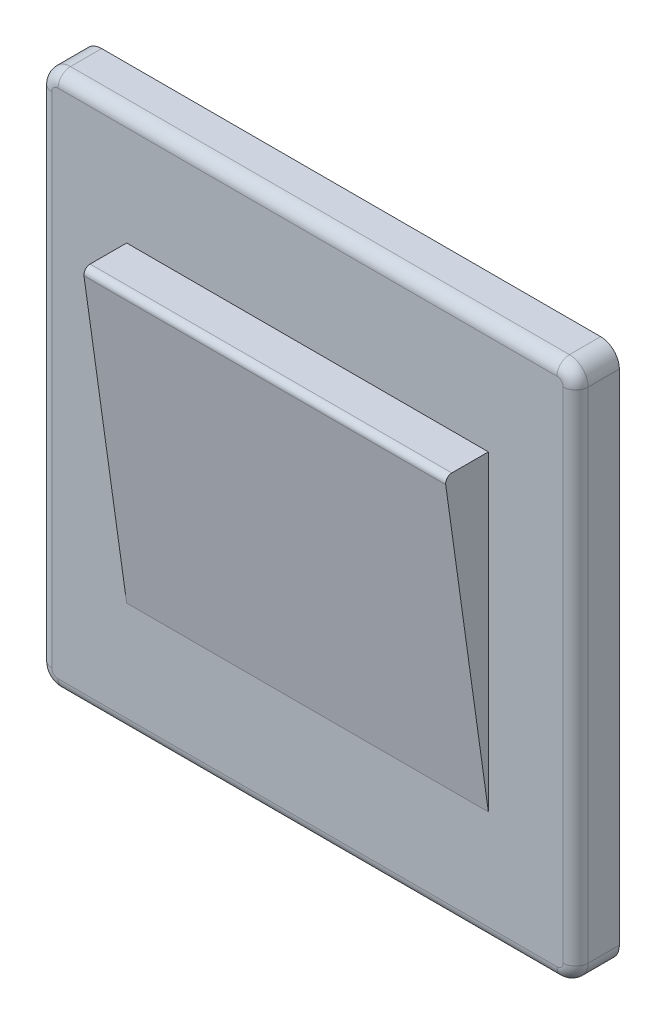
ISO-10303-21;
HEADER;
FILE_DESCRIPTION(('STEP AP214'),'2;1');
FILE_NAME('part.step','',(''),(''),'','','');
FILE_SCHEMA(('AUTOMOTIVE_DESIGN { 1 0 10303 214 1 1 1 1 }'));
ENDSEC;
DATA;
#1=APPLICATION_CONTEXT('core data for automotive mechanical design processes');
#2=APPLICATION_PROTOCOL_DEFINITION('international standard','automotive_design',2000,#1);
#3=PRODUCT_CONTEXT('',#1,'mechanical');
#4=PRODUCT('Part','Part','',(#3));
#5=PRODUCT_RELATED_PRODUCT_CATEGORY('part','',(#4));
#6=PRODUCT_DEFINITION_FORMATION('','',#4);
#7=PRODUCT_DEFINITION_CONTEXT('part definition',#1,'design');
#8=PRODUCT_DEFINITION('design','',#6,#7);
#9=PRODUCT_DEFINITION_SHAPE('','',#8);
#10=(LENGTH_UNIT() NAMED_UNIT(*) SI_UNIT(.MILLI.,.METRE.));
#11=(NAMED_UNIT(*) PLANE_ANGLE_UNIT() SI_UNIT($,.RADIAN.));
#12=(NAMED_UNIT(*) SI_UNIT($,.STERADIAN.) SOLID_ANGLE_UNIT());
#13=UNCERTAINTY_MEASURE_WITH_UNIT(LENGTH_MEASURE(1.E-05),#10,'distance_accuracy_value','');
#14=(GEOMETRIC_REPRESENTATION_CONTEXT(3) GLOBAL_UNCERTAINTY_ASSIGNED_CONTEXT((#13)) GLOBAL_UNIT_ASSIGNED_CONTEXT((#10,
#11,#12)) REPRESENTATION_CONTEXT('',''));
#15=CARTESIAN_POINT('',(0.,0.,0.));
#16=DIRECTION('',(0.,0.,1.));
#17=DIRECTION('',(1.,0.,0.));
#18=AXIS2_PLACEMENT_3D('',#15,#16,#17);
#19=CARTESIAN_POINT('',(0.,0.,7.));
#20=DIRECTION('',(0.,1.,0.));
#21=DIRECTION('',(0.,0.,1.));
#22=AXIS2_PLACEMENT_3D('',#19,#20,#21);
#23=PLANE('',#22);
#24=DIRECTION('',(0.,0.,-1.));
#25=VECTOR('',#24,1.);
#26=CARTESIAN_POINT('',(83.,0.,7.));
#27=LINE('',#26,#25);
#28=CARTESIAN_POINT('',(83.,0.,0.));
#29=VERTEX_POINT('',#28);
#30=CARTESIAN_POINT('',(83.,0.,5.));
#31=VERTEX_POINT('',#30);
#32=EDGE_CURVE('E225',#29,#31,#27,.F.);
#33=ORIENTED_EDGE('',*,*,#32,.T.);
#34=DIRECTION('',(1.,0.,0.));
#35=VECTOR('',#34,1.);
#36=CARTESIAN_POINT('',(3.,0.,5.));
#37=LINE('',#36,#35);
#38=CARTESIAN_POINT('',(3.,0.,5.));
#39=VERTEX_POINT('',#38);
#40=EDGE_CURVE('E265',#31,#39,#37,.F.);
#41=ORIENTED_EDGE('',*,*,#40,.T.);
#42=DIRECTION('',(0.,0.,-1.));
#43=VECTOR('',#42,1.);
#44=CARTESIAN_POINT('',(3.,0.,0.));
#45=LINE('',#44,#43);
#46=CARTESIAN_POINT('',(3.,0.,0.));
#47=VERTEX_POINT('',#46);
#48=EDGE_CURVE('E223',#39,#47,#45,.T.);
#49=ORIENTED_EDGE('',*,*,#48,.T.);
#50=DIRECTION('',(1.,0.,0.));
#51=VECTOR('',#50,1.);
#52=CARTESIAN_POINT('',(0.,0.,0.));
#53=LINE('',#52,#51);
#54=EDGE_CURVE('E195',#47,#29,#53,.T.);
#55=ORIENTED_EDGE('',*,*,#54,.T.);
#56=EDGE_LOOP('',(#33,#41,#49,#55));
#57=FACE_BOUND('',#56,.T.);
#58=ADVANCED_FACE('F48',(#57),#23,.F.);
#59=CARTESIAN_POINT('',(86.,0.,7.));
#60=DIRECTION('',(-1.,0.,0.));
#61=DIRECTION('',(0.,0.,1.));
#62=AXIS2_PLACEMENT_3D('',#59,#60,#61);
#63=PLANE('',#62);
#64=DIRECTION('',(0.,0.,-1.));
#65=VECTOR('',#64,1.);
#66=CARTESIAN_POINT('',(86.,83.,7.));
#67=LINE('',#66,#65);
#68=CARTESIAN_POINT('',(86.,83.,0.));
#69=VERTEX_POINT('',#68);
#70=CARTESIAN_POINT('',(86.,83.,5.));
#71=VERTEX_POINT('',#70);
#72=EDGE_CURVE('E221',#69,#71,#67,.F.);
#73=ORIENTED_EDGE('',*,*,#72,.T.);
#74=DIRECTION('',(0.,1.,0.));
#75=VECTOR('',#74,1.);
#76=CARTESIAN_POINT('',(86.,3.,5.));
#77=LINE('',#76,#75);
#78=CARTESIAN_POINT('',(86.,3.,5.));
#79=VERTEX_POINT('',#78);
#80=EDGE_CURVE('E269',#71,#79,#77,.F.);
#81=ORIENTED_EDGE('',*,*,#80,.T.);
#82=DIRECTION('',(0.,0.,-1.));
#83=VECTOR('',#82,1.);
#84=CARTESIAN_POINT('',(86.,3.,7.));
#85=LINE('',#84,#83);
#86=CARTESIAN_POINT('',(86.,3.,0.));
#87=VERTEX_POINT('',#86);
#88=EDGE_CURVE('E219',#79,#87,#85,.T.);
#89=ORIENTED_EDGE('',*,*,#88,.T.);
#90=DIRECTION('',(0.,1.,0.));
#91=VECTOR('',#90,1.);
#92=CARTESIAN_POINT('',(86.,0.,0.));
#93=LINE('',#92,#91);
#94=EDGE_CURVE('E198',#87,#69,#93,.T.);
#95=ORIENTED_EDGE('',*,*,#94,.T.);
#96=EDGE_LOOP('',(#73,#81,#89,#95));
#97=FACE_BOUND('',#96,.T.);
#98=ADVANCED_FACE('F318',(#97),#63,.F.);
#99=CARTESIAN_POINT('',(0.,86.,7.));
#100=DIRECTION('',(0.,1.,0.));
#101=DIRECTION('',(0.,0.,1.));
#102=AXIS2_PLACEMENT_3D('',#99,#100,#101);
#103=PLANE('',#102);
#104=DIRECTION('',(0.,0.,-1.));
#105=VECTOR('',#104,1.);
#106=CARTESIAN_POINT('',(3.,86.,7.));
#107=LINE('',#106,#105);
#108=CARTESIAN_POINT('',(3.,86.,0.));
#109=VERTEX_POINT('',#108);
#110=CARTESIAN_POINT('',(3.,86.,5.));
#111=VERTEX_POINT('',#110);
#112=EDGE_CURVE('E207',#109,#111,#107,.F.);
#113=ORIENTED_EDGE('',*,*,#112,.T.);
#114=DIRECTION('',(1.,0.,0.));
#115=VECTOR('',#114,1.);
#116=CARTESIAN_POINT('',(0.,86.,5.));
#117=LINE('',#116,#115);
#118=CARTESIAN_POINT('',(83.,86.,5.));
#119=VERTEX_POINT('',#118);
#120=EDGE_CURVE('E11',#111,#119,#117,.T.);
#121=ORIENTED_EDGE('',*,*,#120,.T.);
#122=DIRECTION('',(0.,0.,-1.));
#123=VECTOR('',#122,1.);
#124=CARTESIAN_POINT('',(83.,86.,0.));
#125=LINE('',#124,#123);
#126=CARTESIAN_POINT('',(83.,86.,0.));
#127=VERTEX_POINT('',#126);
#128=EDGE_CURVE('E209',#119,#127,#125,.T.);
#129=ORIENTED_EDGE('',*,*,#128,.T.);
#130=DIRECTION('',(1.,0.,0.));
#131=VECTOR('',#130,1.);
#132=CARTESIAN_POINT('',(0.,86.,0.));
#133=LINE('',#132,#131);
#134=EDGE_CURVE('E201',#109,#127,#133,.T.);
#135=ORIENTED_EDGE('',*,*,#134,.F.);
#136=EDGE_LOOP('',(#113,#121,#129,#135));
#137=FACE_BOUND('',#136,.T.);
#138=ADVANCED_FACE('F323',(#137),#103,.T.);
#139=CARTESIAN_POINT('',(0.,0.,7.));
#140=DIRECTION('',(-1.,0.,0.));
#141=DIRECTION('',(0.,0.,1.));
#142=AXIS2_PLACEMENT_3D('',#139,#140,#141);
#143=PLANE('',#142);
#144=DIRECTION('',(0.,0.,-1.));
#145=VECTOR('',#144,1.);
#146=CARTESIAN_POINT('',(0.,3.,7.));
#147=LINE('',#146,#145);
#148=CARTESIAN_POINT('',(0.,3.,0.));
#149=VERTEX_POINT('',#148);
#150=CARTESIAN_POINT('',(0.,3.,5.));
#151=VERTEX_POINT('',#150);
#152=EDGE_CURVE('E230',#149,#151,#147,.F.);
#153=ORIENTED_EDGE('',*,*,#152,.T.);
#154=DIRECTION('',(0.,1.,0.));
#155=VECTOR('',#154,1.);
#156=CARTESIAN_POINT('',(0.,0.,5.));
#157=LINE('',#156,#155);
#158=CARTESIAN_POINT('',(0.,83.,5.));
#159=VERTEX_POINT('',#158);
#160=EDGE_CURVE('E261',#151,#159,#157,.T.);
#161=ORIENTED_EDGE('',*,*,#160,.T.);
#162=DIRECTION('',(0.,0.,-1.));
#163=VECTOR('',#162,1.);
#164=CARTESIAN_POINT('',(0.,83.,7.));
#165=LINE('',#164,#163);
#166=CARTESIAN_POINT('',(0.,83.,0.));
#167=VERTEX_POINT('',#166);
#168=EDGE_CURVE('E228',#159,#167,#165,.T.);
#169=ORIENTED_EDGE('',*,*,#168,.T.);
#170=DIRECTION('',(0.,1.,0.));
#171=VECTOR('',#170,1.);
#172=CARTESIAN_POINT('',(0.,0.,0.));
#173=LINE('',#172,#171);
#174=EDGE_CURVE('E204',#149,#167,#173,.T.);
#175=ORIENTED_EDGE('',*,*,#174,.F.);
#176=EDGE_LOOP('',(#153,#161,#169,#175));
#177=FACE_BOUND('',#176,.T.);
#178=ADVANCED_FACE('F410',(#177),#143,.T.);
#179=CARTESIAN_POINT('',(0.,0.,7.));
#180=DIRECTION('',(0.,0.,1.));
#181=DIRECTION('',(1.,0.,0.));
#182=AXIS2_PLACEMENT_3D('',#179,#180,#181);
#183=PLANE('',#182);
#184=DIRECTION('',(1.,0.,0.));
#185=VECTOR('',#184,1.);
#186=CARTESIAN_POINT('',(0.,84.,7.));
#187=LINE('',#186,#185);
#188=CARTESIAN_POINT('',(83.,84.,7.));
#189=VERTEX_POINT('',#188);
#190=CARTESIAN_POINT('',(3.,84.,7.));
#191=VERTEX_POINT('',#190);
#192=EDGE_CURVE('E241',#189,#191,#187,.F.);
#193=ORIENTED_EDGE('',*,*,#192,.T.);
#194=CARTESIAN_POINT('',(3.,83.,7.));
#195=DIRECTION('',(0.,0.,1.));
#196=DIRECTION('',(1.,0.,0.));
#197=AXIS2_PLACEMENT_3D('',#194,#195,#196);
#198=CIRCLE('',#197,1.);
#199=CARTESIAN_POINT('',(2.,83.,7.));
#200=VERTEX_POINT('',#199);
#201=EDGE_CURVE('E255',#191,#200,#198,.T.);
#202=ORIENTED_EDGE('',*,*,#201,.T.);
#203=DIRECTION('',(0.,1.,0.));
#204=VECTOR('',#203,1.);
#205=CARTESIAN_POINT('',(2.,0.,7.));
#206=LINE('',#205,#204);
#207=CARTESIAN_POINT('',(2.,3.,7.));
#208=VERTEX_POINT('',#207);
#209=EDGE_CURVE('E253',#200,#208,#206,.F.);
#210=ORIENTED_EDGE('',*,*,#209,.T.);
#211=CARTESIAN_POINT('',(3.,3.,7.));
#212=DIRECTION('',(0.,0.,1.));
#213=DIRECTION('',(1.,0.,0.));
#214=AXIS2_PLACEMENT_3D('',#211,#212,#213);
#215=CIRCLE('',#214,1.);
#216=CARTESIAN_POINT('',(3.,2.,7.));
#217=VERTEX_POINT('',#216);
#218=EDGE_CURVE('E251',#208,#217,#215,.T.);
#219=ORIENTED_EDGE('',*,*,#218,.T.);
#220=DIRECTION('',(1.,0.,0.));
#221=VECTOR('',#220,1.);
#222=CARTESIAN_POINT('',(83.,2.,7.));
#223=LINE('',#222,#221);
#224=CARTESIAN_POINT('',(83.,2.,7.));
#225=VERTEX_POINT('',#224);
#226=EDGE_CURVE('E249',#217,#225,#223,.T.);
#227=ORIENTED_EDGE('',*,*,#226,.T.);
#228=CARTESIAN_POINT('',(83.,3.,7.));
#229=DIRECTION('',(0.,0.,1.));
#230=DIRECTION('',(1.,0.,0.));
#231=AXIS2_PLACEMENT_3D('',#228,#229,#230);
#232=CIRCLE('',#231,1.);
#233=CARTESIAN_POINT('',(84.,3.,7.));
#234=VERTEX_POINT('',#233);
#235=EDGE_CURVE('E247',#225,#234,#232,.T.);
#236=ORIENTED_EDGE('',*,*,#235,.T.);
#237=DIRECTION('',(0.,1.,0.));
#238=VECTOR('',#237,1.);
#239=CARTESIAN_POINT('',(84.,83.,7.));
#240=LINE('',#239,#238);
#241=CARTESIAN_POINT('',(84.,83.,7.));
#242=VERTEX_POINT('',#241);
#243=EDGE_CURVE('E245',#234,#242,#240,.T.);
#244=ORIENTED_EDGE('',*,*,#243,.T.);
#245=CARTESIAN_POINT('',(83.,83.,7.));
#246=DIRECTION('',(0.,0.,1.));
#247=DIRECTION('',(1.,0.,0.));
#248=AXIS2_PLACEMENT_3D('',#245,#246,#247);
#249=CIRCLE('',#248,1.);
#250=EDGE_CURVE('E243',#242,#189,#249,.T.);
#251=ORIENTED_EDGE('',*,*,#250,.T.);
#252=EDGE_LOOP('',(#193,#202,#210,#219,#227,#236,#244,#251));
#253=FACE_BOUND('',#252,.T.);
#254=DIRECTION('',(0.,1.,0.));
#255=VECTOR('',#254,1.);
#256=CARTESIAN_POINT('',(72.,0.,7.));
#257=LINE('',#256,#255);
#258=CARTESIAN_POINT('',(72.,18.,7.));
#259=VERTEX_POINT('',#258);
#260=CARTESIAN_POINT('',(72.,68.,7.));
#261=VERTEX_POINT('',#260);
#262=EDGE_CURVE('E187',#259,#261,#257,.T.);
#263=ORIENTED_EDGE('',*,*,#262,.F.);
#264=DIRECTION('',(-1.,0.,0.));
#265=VECTOR('',#264,1.);
#266=CARTESIAN_POINT('',(0.,18.,7.));
#267=LINE('',#266,#265);
#268=CARTESIAN_POINT('',(14.,18.,7.));
#269=VERTEX_POINT('',#268);
#270=EDGE_CURVE('E166',#259,#269,#267,.T.);
#271=ORIENTED_EDGE('',*,*,#270,.T.);
#272=DIRECTION('',(0.,1.,0.));
#273=VECTOR('',#272,1.);
#274=CARTESIAN_POINT('',(14.,0.,7.));
#275=LINE('',#274,#273);
#276=CARTESIAN_POINT('',(14.,68.,7.));
#277=VERTEX_POINT('',#276);
#278=EDGE_CURVE('E175',#269,#277,#275,.T.);
#279=ORIENTED_EDGE('',*,*,#278,.T.);
#280=DIRECTION('',(-1.,0.,0.));
#281=VECTOR('',#280,1.);
#282=CARTESIAN_POINT('',(0.,68.,7.));
#283=LINE('',#282,#281);
#284=EDGE_CURVE('E182',#261,#277,#283,.T.);
#285=ORIENTED_EDGE('',*,*,#284,.F.);
#286=EDGE_LOOP('',(#263,#271,#279,#285));
#287=FACE_BOUND('',#286,.T.);
#288=ADVANCED_FACE('F185',(#253,#287),#183,.T.);
#289=CARTESIAN_POINT('',(0.,0.,0.));
#290=DIRECTION('',(0.,0.,1.));
#291=DIRECTION('',(1.,0.,0.));
#292=AXIS2_PLACEMENT_3D('',#289,#290,#291);
#293=PLANE('',#292);
#294=ORIENTED_EDGE('',*,*,#134,.T.);
#295=CARTESIAN_POINT('',(83.,83.,0.));
#296=DIRECTION('',(0.,0.,1.));
#297=DIRECTION('',(1.,0.,0.));
#298=AXIS2_PLACEMENT_3D('',#295,#296,#297);
#299=CIRCLE('',#298,3.);
#300=EDGE_CURVE('E217',#127,#69,#299,.F.);
#301=ORIENTED_EDGE('',*,*,#300,.T.);
#302=ORIENTED_EDGE('',*,*,#94,.F.);
#303=CARTESIAN_POINT('',(83.,3.,0.));
#304=DIRECTION('',(0.,0.,1.));
#305=DIRECTION('',(1.,0.,0.));
#306=AXIS2_PLACEMENT_3D('',#303,#304,#305);
#307=CIRCLE('',#306,3.);
#308=EDGE_CURVE('E215',#87,#29,#307,.F.);
#309=ORIENTED_EDGE('',*,*,#308,.T.);
#310=ORIENTED_EDGE('',*,*,#54,.F.);
#311=CARTESIAN_POINT('',(3.,3.,0.));
#312=DIRECTION('',(0.,0.,1.));
#313=DIRECTION('',(1.,0.,0.));
#314=AXIS2_PLACEMENT_3D('',#311,#312,#313);
#315=CIRCLE('',#314,3.);
#316=EDGE_CURVE('E213',#47,#149,#315,.F.);
#317=ORIENTED_EDGE('',*,*,#316,.T.);
#318=ORIENTED_EDGE('',*,*,#174,.T.);
#319=CARTESIAN_POINT('',(3.,83.,0.));
#320=DIRECTION('',(0.,0.,1.));
#321=DIRECTION('',(1.,0.,0.));
#322=AXIS2_PLACEMENT_3D('',#319,#320,#321);
#323=CIRCLE('',#322,3.);
#324=EDGE_CURVE('E211',#167,#109,#323,.F.);
#325=ORIENTED_EDGE('',*,*,#324,.T.);
#326=EDGE_LOOP('',(#294,#301,#302,#309,#310,#317,#318,#325));
#327=FACE_BOUND('',#326,.T.);
#328=ADVANCED_FACE('F313',(#327),#293,.F.);
#329=CARTESIAN_POINT('',(72.,0.,14.));
#330=DIRECTION('',(1.,0.,0.));
#331=DIRECTION('',(0.,1.,0.));
#332=AXIS2_PLACEMENT_3D('',#329,#330,#331);
#333=PLANE('',#332);
#334=DIRECTION('',(0.,0.,-1.));
#335=VECTOR('',#334,1.);
#336=CARTESIAN_POINT('',(72.,68.,14.));
#337=LINE('',#336,#335);
#338=CARTESIAN_POINT('',(72.,68.,12.8502475550909));
#339=VERTEX_POINT('',#338);
#340=EDGE_CURVE('E188',#339,#261,#337,.T.);
#341=ORIENTED_EDGE('',*,*,#340,.F.);
#342=CARTESIAN_POINT('',(72.,67.,12.8502475550909));
#343=DIRECTION('',(1.,0.,0.));
#344=DIRECTION('',(0.,1.,0.));
#345=AXIS2_PLACEMENT_3D('',#342,#343,#344);
#346=CIRCLE('',#345,1.);
#347=CARTESIAN_POINT('',(72.,66.8613521554656,13.8405893017652));
#348=VERTEX_POINT('',#347);
#349=EDGE_CURVE('E236',#339,#348,#346,.T.);
#350=ORIENTED_EDGE('',*,*,#349,.T.);
#351=DIRECTION('',(0.,0.99034174667433,0.138647844534406));
#352=VECTOR('',#351,1.);
#353=CARTESIAN_POINT('',(72.,1.30717928599453,4.66300510003923));
#354=LINE('',#353,#352);
#355=EDGE_CURVE('E172',#259,#348,#354,.T.);
#356=ORIENTED_EDGE('',*,*,#355,.F.);
#357=ORIENTED_EDGE('',*,*,#262,.T.);
#358=EDGE_LOOP('',(#341,#350,#356,#357));
#359=FACE_BOUND('',#358,.T.);
#360=ADVANCED_FACE('F433',(#359),#333,.T.);
#361=CARTESIAN_POINT('',(0.,68.,14.));
#362=DIRECTION('',(0.,1.,0.));
#363=DIRECTION('',(0.,0.,1.));
#364=AXIS2_PLACEMENT_3D('',#361,#362,#363);
#365=PLANE('',#364);
#366=DIRECTION('',(0.,0.,-1.));
#367=VECTOR('',#366,1.);
#368=CARTESIAN_POINT('',(14.,68.,14.));
#369=LINE('',#368,#367);
#370=CARTESIAN_POINT('',(14.,68.,12.8502475550909));
#371=VERTEX_POINT('',#370);
#372=EDGE_CURVE('E178',#371,#277,#369,.T.);
#373=ORIENTED_EDGE('',*,*,#372,.F.);
#374=DIRECTION('',(1.,0.,0.));
#375=VECTOR('',#374,1.);
#376=CARTESIAN_POINT('',(72.,68.,12.8502475550909));
#377=LINE('',#376,#375);
#378=EDGE_CURVE('E233',#371,#339,#377,.T.);
#379=ORIENTED_EDGE('',*,*,#378,.T.);
#380=ORIENTED_EDGE('',*,*,#340,.T.);
#381=ORIENTED_EDGE('',*,*,#284,.T.);
#382=EDGE_LOOP('',(#373,#379,#380,#381));
#383=FACE_BOUND('',#382,.T.);
#384=ADVANCED_FACE('F441',(#383),#365,.T.);
#385=CARTESIAN_POINT('',(14.,0.,14.));
#386=DIRECTION('',(1.,0.,0.));
#387=DIRECTION('',(0.,1.,0.));
#388=AXIS2_PLACEMENT_3D('',#385,#386,#387);
#389=PLANE('',#388);
#390=DIRECTION('',(0.,-0.99034174667433,-0.138647844534406));
#391=VECTOR('',#390,1.);
#392=CARTESIAN_POINT('',(14.,68.,14.));
#393=LINE('',#392,#391);
#394=CARTESIAN_POINT('',(14.,66.8613521554656,13.8405893017652));
#395=VERTEX_POINT('',#394);
#396=EDGE_CURVE('E161',#395,#269,#393,.T.);
#397=ORIENTED_EDGE('',*,*,#396,.F.);
#398=CARTESIAN_POINT('',(14.,67.,12.8502475550909));
#399=DIRECTION('',(1.,0.,0.));
#400=DIRECTION('',(0.,1.,0.));
#401=AXIS2_PLACEMENT_3D('',#398,#399,#400);
#402=CIRCLE('',#401,1.);
#403=EDGE_CURVE('E239',#395,#371,#402,.F.);
#404=ORIENTED_EDGE('',*,*,#403,.T.);
#405=ORIENTED_EDGE('',*,*,#372,.T.);
#406=ORIENTED_EDGE('',*,*,#278,.F.);
#407=EDGE_LOOP('',(#397,#404,#405,#406));
#408=FACE_BOUND('',#407,.T.);
#409=ADVANCED_FACE('F176',(#408),#389,.F.);
#410=CARTESIAN_POINT('',(86.,68.,14.));
#411=DIRECTION('',(0.,0.138647844534406,-0.99034174667433));
#412=DIRECTION('',(0.,0.99034174667433,0.138647844534406));
#413=AXIS2_PLACEMENT_3D('',#410,#411,#412);
#414=PLANE('',#413);
#415=ORIENTED_EDGE('',*,*,#355,.T.);
#416=DIRECTION('',(1.,0.,0.));
#417=VECTOR('',#416,1.);
#418=CARTESIAN_POINT('',(14.,66.8613521554656,13.8405893017652));
#419=LINE('',#418,#417);
#420=EDGE_CURVE('E169',#348,#395,#419,.F.);
#421=ORIENTED_EDGE('',*,*,#420,.T.);
#422=ORIENTED_EDGE('',*,*,#396,.T.);
#423=ORIENTED_EDGE('',*,*,#270,.F.);
#424=EDGE_LOOP('',(#415,#421,#422,#423));
#425=FACE_BOUND('',#424,.T.);
#426=ADVANCED_FACE('F164',(#425),#414,.F.);
#427=CARTESIAN_POINT('',(83.,83.,7.));
#428=DIRECTION('',(0.,0.,1.));
#429=DIRECTION('',(1.,0.,0.));
#430=AXIS2_PLACEMENT_3D('',#427,#428,#429);
#431=CYLINDRICAL_SURFACE('',#430,3.);
#432=ORIENTED_EDGE('',*,*,#128,.F.);
#433=CARTESIAN_POINT('',(83.,83.,5.));
#434=DIRECTION('',(0.,0.,1.));
#435=DIRECTION('',(1.,0.,0.));
#436=AXIS2_PLACEMENT_3D('',#433,#434,#435);
#437=CIRCLE('',#436,3.);
#438=EDGE_CURVE('E57',#119,#71,#437,.F.);
#439=ORIENTED_EDGE('',*,*,#438,.T.);
#440=ORIENTED_EDGE('',*,*,#72,.F.);
#441=ORIENTED_EDGE('',*,*,#300,.F.);
#442=EDGE_LOOP('',(#432,#439,#440,#441));
#443=FACE_BOUND('',#442,.T.);
#444=ADVANCED_FACE('F319',(#443),#431,.T.);
#445=CARTESIAN_POINT('',(83.,3.,7.));
#446=DIRECTION('',(0.,0.,-1.));
#447=DIRECTION('',(-1.,0.,0.));
#448=AXIS2_PLACEMENT_3D('',#445,#446,#447);
#449=CYLINDRICAL_SURFACE('',#448,3.);
#450=ORIENTED_EDGE('',*,*,#88,.F.);
#451=CARTESIAN_POINT('',(83.,3.,5.));
#452=DIRECTION('',(0.,0.,1.));
#453=DIRECTION('',(1.,0.,0.));
#454=AXIS2_PLACEMENT_3D('',#451,#452,#453);
#455=CIRCLE('',#454,3.);
#456=EDGE_CURVE('E267',#79,#31,#455,.F.);
#457=ORIENTED_EDGE('',*,*,#456,.T.);
#458=ORIENTED_EDGE('',*,*,#32,.F.);
#459=ORIENTED_EDGE('',*,*,#308,.F.);
#460=EDGE_LOOP('',(#450,#457,#458,#459));
#461=FACE_BOUND('',#460,.T.);
#462=ADVANCED_FACE('F306',(#461),#449,.T.);
#463=CARTESIAN_POINT('',(3.,3.,7.));
#464=DIRECTION('',(0.,0.,1.));
#465=DIRECTION('',(1.,0.,0.));
#466=AXIS2_PLACEMENT_3D('',#463,#464,#465);
#467=CYLINDRICAL_SURFACE('',#466,3.);
#468=ORIENTED_EDGE('',*,*,#48,.F.);
#469=CARTESIAN_POINT('',(3.,3.,5.));
#470=DIRECTION('',(0.,0.,1.));
#471=DIRECTION('',(1.,0.,0.));
#472=AXIS2_PLACEMENT_3D('',#469,#470,#471);
#473=CIRCLE('',#472,3.);
#474=EDGE_CURVE('E263',#39,#151,#473,.F.);
#475=ORIENTED_EDGE('',*,*,#474,.T.);
#476=ORIENTED_EDGE('',*,*,#152,.F.);
#477=ORIENTED_EDGE('',*,*,#316,.F.);
#478=EDGE_LOOP('',(#468,#475,#476,#477));
#479=FACE_BOUND('',#478,.T.);
#480=ADVANCED_FACE('F370',(#479),#467,.T.);
#481=CARTESIAN_POINT('',(3.,83.,7.));
#482=DIRECTION('',(0.,0.,-1.));
#483=DIRECTION('',(-1.,0.,0.));
#484=AXIS2_PLACEMENT_3D('',#481,#482,#483);
#485=CYLINDRICAL_SURFACE('',#484,3.);
#486=ORIENTED_EDGE('',*,*,#168,.F.);
#487=CARTESIAN_POINT('',(3.,83.,5.));
#488=DIRECTION('',(0.,0.,1.));
#489=DIRECTION('',(1.,0.,0.));
#490=AXIS2_PLACEMENT_3D('',#487,#488,#489);
#491=CIRCLE('',#490,3.);
#492=EDGE_CURVE('E258',#159,#111,#491,.F.);
#493=ORIENTED_EDGE('',*,*,#492,.T.);
#494=ORIENTED_EDGE('',*,*,#112,.F.);
#495=ORIENTED_EDGE('',*,*,#324,.F.);
#496=EDGE_LOOP('',(#486,#493,#494,#495));
#497=FACE_BOUND('',#496,.T.);
#498=ADVANCED_FACE('F326',(#497),#485,.T.);
#499=CARTESIAN_POINT('',(0.,67.,12.8502475550909));
#500=DIRECTION('',(-1.,0.,0.));
#501=DIRECTION('',(0.,0.,1.));
#502=AXIS2_PLACEMENT_3D('',#499,#500,#501);
#503=CYLINDRICAL_SURFACE('',#502,1.);
#504=ORIENTED_EDGE('',*,*,#403,.F.);
#505=ORIENTED_EDGE('',*,*,#420,.F.);
#506=ORIENTED_EDGE('',*,*,#349,.F.);
#507=ORIENTED_EDGE('',*,*,#378,.F.);
#508=EDGE_LOOP('',(#504,#505,#506,#507));
#509=FACE_BOUND('',#508,.T.);
#510=ADVANCED_FACE('F376',(#509),#503,.T.);
#511=CARTESIAN_POINT('',(83.,3.,5.));
#512=DIRECTION('',(0.,0.,1.));
#513=DIRECTION('',(1.,0.,0.));
#514=AXIS2_PLACEMENT_3D('',#511,#512,#513);
#515=DEGENERATE_TOROIDAL_SURFACE('',#514,1.,2.,.T.);
#516=CARTESIAN_POINT('',(83.,2.,5.));
#517=DIRECTION('',(-1.,0.,0.));
#518=DIRECTION('',(0.,0.,1.));
#519=AXIS2_PLACEMENT_3D('',#516,#517,#518);
#520=CIRCLE('',#519,2.);
#521=EDGE_CURVE('E287',#31,#225,#520,.T.);
#522=ORIENTED_EDGE('',*,*,#521,.F.);
#523=ORIENTED_EDGE('',*,*,#456,.F.);
#524=CARTESIAN_POINT('',(84.,3.,5.));
#525=DIRECTION('',(0.,1.,0.));
#526=DIRECTION('',(0.,0.,1.));
#527=AXIS2_PLACEMENT_3D('',#524,#525,#526);
#528=CIRCLE('',#527,2.);
#529=EDGE_CURVE('E52',#234,#79,#528,.T.);
#530=ORIENTED_EDGE('',*,*,#529,.F.);
#531=ORIENTED_EDGE('',*,*,#235,.F.);
#532=EDGE_LOOP('',(#522,#523,#530,#531));
#533=FACE_BOUND('',#532,.T.);
#534=ADVANCED_FACE('F50',(#533),#515,.T.);
#535=CARTESIAN_POINT('',(84.,0.,5.));
#536=DIRECTION('',(0.,-1.,0.));
#537=DIRECTION('',(0.,0.,-1.));
#538=AXIS2_PLACEMENT_3D('',#535,#536,#537);
#539=CYLINDRICAL_SURFACE('',#538,2.);
#540=ORIENTED_EDGE('',*,*,#529,.T.);
#541=ORIENTED_EDGE('',*,*,#80,.F.);
#542=CARTESIAN_POINT('',(84.,83.,5.));
#543=DIRECTION('',(0.,1.,0.));
#544=DIRECTION('',(0.,0.,1.));
#545=AXIS2_PLACEMENT_3D('',#542,#543,#544);
#546=CIRCLE('',#545,2.);
#547=EDGE_CURVE('E285',#242,#71,#546,.T.);
#548=ORIENTED_EDGE('',*,*,#547,.F.);
#549=ORIENTED_EDGE('',*,*,#243,.F.);
#550=EDGE_LOOP('',(#540,#541,#548,#549));
#551=FACE_BOUND('',#550,.T.);
#552=ADVANCED_FACE('F298',(#551),#539,.T.);
#553=CARTESIAN_POINT('',(0.,2.,5.));
#554=DIRECTION('',(-1.,0.,0.));
#555=DIRECTION('',(0.,0.,1.));
#556=AXIS2_PLACEMENT_3D('',#553,#554,#555);
#557=CYLINDRICAL_SURFACE('',#556,2.);
#558=ORIENTED_EDGE('',*,*,#521,.T.);
#559=ORIENTED_EDGE('',*,*,#226,.F.);
#560=CARTESIAN_POINT('',(3.,2.,5.));
#561=DIRECTION('',(-1.,0.,0.));
#562=DIRECTION('',(0.,0.,1.));
#563=AXIS2_PLACEMENT_3D('',#560,#561,#562);
#564=CIRCLE('',#563,2.);
#565=EDGE_CURVE('E282',#39,#217,#564,.T.);
#566=ORIENTED_EDGE('',*,*,#565,.F.);
#567=ORIENTED_EDGE('',*,*,#40,.F.);
#568=EDGE_LOOP('',(#558,#559,#566,#567));
#569=FACE_BOUND('',#568,.T.);
#570=ADVANCED_FACE('F349',(#569),#557,.T.);
#571=CARTESIAN_POINT('',(83.,83.,5.));
#572=DIRECTION('',(0.,0.,1.));
#573=DIRECTION('',(1.,0.,0.));
#574=AXIS2_PLACEMENT_3D('',#571,#572,#573);
#575=DEGENERATE_TOROIDAL_SURFACE('',#574,1.,2.,.T.);
#576=ORIENTED_EDGE('',*,*,#547,.T.);
#577=ORIENTED_EDGE('',*,*,#438,.F.);
#578=CARTESIAN_POINT('',(83.,84.,5.));
#579=DIRECTION('',(-1.,0.,0.));
#580=DIRECTION('',(0.,0.,1.));
#581=AXIS2_PLACEMENT_3D('',#578,#579,#580);
#582=CIRCLE('',#581,2.);
#583=EDGE_CURVE('E279',#189,#119,#582,.T.);
#584=ORIENTED_EDGE('',*,*,#583,.F.);
#585=ORIENTED_EDGE('',*,*,#250,.F.);
#586=EDGE_LOOP('',(#576,#577,#584,#585));
#587=FACE_BOUND('',#586,.T.);
#588=ADVANCED_FACE('F346',(#587),#575,.T.);
#589=CARTESIAN_POINT('',(3.,3.,5.));
#590=DIRECTION('',(0.,0.,1.));
#591=DIRECTION('',(1.,0.,0.));
#592=AXIS2_PLACEMENT_3D('',#589,#590,#591);
#593=DEGENERATE_TOROIDAL_SURFACE('',#592,1.,2.,.T.);
#594=ORIENTED_EDGE('',*,*,#565,.T.);
#595=ORIENTED_EDGE('',*,*,#218,.F.);
#596=CARTESIAN_POINT('',(2.,3.,5.));
#597=DIRECTION('',(0.,1.,0.));
#598=DIRECTION('',(0.,0.,1.));
#599=AXIS2_PLACEMENT_3D('',#596,#597,#598);
#600=CIRCLE('',#599,2.);
#601=EDGE_CURVE('E276',#151,#208,#600,.T.);
#602=ORIENTED_EDGE('',*,*,#601,.F.);
#603=ORIENTED_EDGE('',*,*,#474,.F.);
#604=EDGE_LOOP('',(#594,#595,#602,#603));
#605=FACE_BOUND('',#604,.T.);
#606=ADVANCED_FACE('F348',(#605),#593,.T.);
#607=CARTESIAN_POINT('',(0.,84.,5.));
#608=DIRECTION('',(1.,0.,0.));
#609=DIRECTION('',(0.,0.,-1.));
#610=AXIS2_PLACEMENT_3D('',#607,#608,#609);
#611=CYLINDRICAL_SURFACE('',#610,2.);
#612=ORIENTED_EDGE('',*,*,#583,.T.);
#613=ORIENTED_EDGE('',*,*,#120,.F.);
#614=CARTESIAN_POINT('',(3.,84.,5.));
#615=DIRECTION('',(-1.,0.,0.));
#616=DIRECTION('',(0.,0.,1.));
#617=AXIS2_PLACEMENT_3D('',#614,#615,#616);
#618=CIRCLE('',#617,2.);
#619=EDGE_CURVE('E274',#191,#111,#618,.T.);
#620=ORIENTED_EDGE('',*,*,#619,.F.);
#621=ORIENTED_EDGE('',*,*,#192,.F.);
#622=EDGE_LOOP('',(#612,#613,#620,#621));
#623=FACE_BOUND('',#622,.T.);
#624=ADVANCED_FACE('F344',(#623),#611,.T.);
#625=CARTESIAN_POINT('',(2.,0.,5.));
#626=DIRECTION('',(0.,1.,0.));
#627=DIRECTION('',(0.,0.,1.));
#628=AXIS2_PLACEMENT_3D('',#625,#626,#627);
#629=CYLINDRICAL_SURFACE('',#628,2.);
#630=ORIENTED_EDGE('',*,*,#601,.T.);
#631=ORIENTED_EDGE('',*,*,#209,.F.);
#632=CARTESIAN_POINT('',(2.,83.,5.));
#633=DIRECTION('',(0.,1.,0.));
#634=DIRECTION('',(0.,0.,1.));
#635=AXIS2_PLACEMENT_3D('',#632,#633,#634);
#636=CIRCLE('',#635,2.);
#637=EDGE_CURVE('E272',#159,#200,#636,.T.);
#638=ORIENTED_EDGE('',*,*,#637,.F.);
#639=ORIENTED_EDGE('',*,*,#160,.F.);
#640=EDGE_LOOP('',(#630,#631,#638,#639));
#641=FACE_BOUND('',#640,.T.);
#642=ADVANCED_FACE('F336',(#641),#629,.T.);
#643=CARTESIAN_POINT('',(3.,83.,5.));
#644=DIRECTION('',(0.,0.,1.));
#645=DIRECTION('',(1.,0.,0.));
#646=AXIS2_PLACEMENT_3D('',#643,#644,#645);
#647=DEGENERATE_TOROIDAL_SURFACE('',#646,1.,2.,.T.);
#648=ORIENTED_EDGE('',*,*,#619,.T.);
#649=ORIENTED_EDGE('',*,*,#492,.F.);
#650=ORIENTED_EDGE('',*,*,#637,.T.);
#651=ORIENTED_EDGE('',*,*,#201,.F.);
#652=EDGE_LOOP('',(#648,#649,#650,#651));
#653=FACE_BOUND('',#652,.T.);
#654=ADVANCED_FACE('F330',(#653),#647,.T.);
#655=CLOSED_SHELL('',(#58,#98,#138,#178,#288,#328,#360,#384,#409,#426,#444,#462,#480,#498,#510,
#534,#552,#570,#588,#606,#624,#642,#654));
#656=MANIFOLD_SOLID_BREP('B2',#655);
#657=ADVANCED_BREP_SHAPE_REPRESENTATION('',(#18,#656),#14);
#658=SHAPE_DEFINITION_REPRESENTATION(#9,#657);
ENDSEC;
END-ISO-10303-21;
